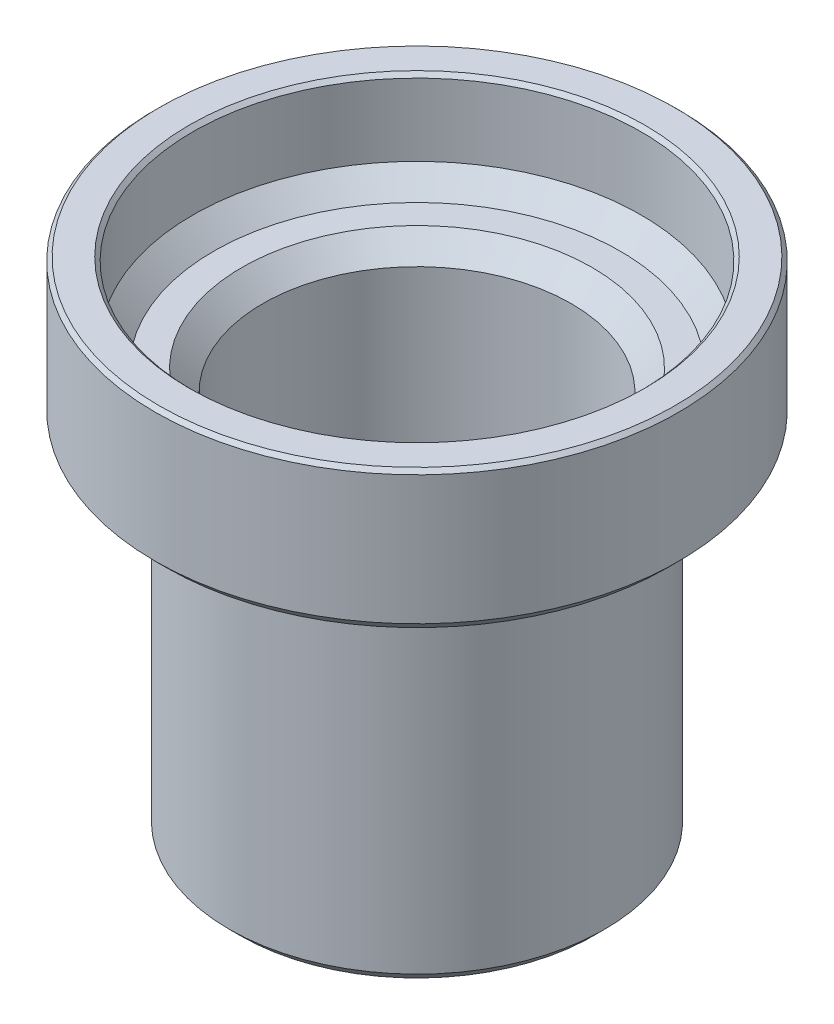
ISO-10303-21;
HEADER;
FILE_DESCRIPTION(('STEP AP214'),'2;1');
FILE_NAME('part.step','',(''),(''),'','','');
FILE_SCHEMA(('AUTOMOTIVE_DESIGN { 1 0 10303 214 1 1 1 1 }'));
ENDSEC;
DATA;
#1=APPLICATION_CONTEXT('core data for automotive mechanical design processes');
#2=APPLICATION_PROTOCOL_DEFINITION('international standard','automotive_design',2000,#1);
#3=PRODUCT_CONTEXT('',#1,'mechanical');
#4=PRODUCT('Part','Part','',(#3));
#5=PRODUCT_RELATED_PRODUCT_CATEGORY('part','',(#4));
#6=PRODUCT_DEFINITION_FORMATION('','',#4);
#7=PRODUCT_DEFINITION_CONTEXT('part definition',#1,'design');
#8=PRODUCT_DEFINITION('design','',#6,#7);
#9=PRODUCT_DEFINITION_SHAPE('','',#8);
#10=(LENGTH_UNIT() NAMED_UNIT(*) SI_UNIT(.MILLI.,.METRE.));
#11=(NAMED_UNIT(*) PLANE_ANGLE_UNIT() SI_UNIT($,.RADIAN.));
#12=(NAMED_UNIT(*) SI_UNIT($,.STERADIAN.) SOLID_ANGLE_UNIT());
#13=UNCERTAINTY_MEASURE_WITH_UNIT(LENGTH_MEASURE(1.E-05),#10,'distance_accuracy_value','');
#14=(GEOMETRIC_REPRESENTATION_CONTEXT(3) GLOBAL_UNCERTAINTY_ASSIGNED_CONTEXT((#13)) GLOBAL_UNIT_ASSIGNED_CONTEXT((#10,
#11,#12)) REPRESENTATION_CONTEXT('',''));
#15=CARTESIAN_POINT('',(0.,0.,0.));
#16=DIRECTION('',(0.,0.,1.));
#17=DIRECTION('',(1.,0.,0.));
#18=AXIS2_PLACEMENT_3D('',#15,#16,#17);
#19=CARTESIAN_POINT('',(0.,26.9875,0.));
#20=DIRECTION('',(0.,1.,0.));
#21=DIRECTION('',(0.,0.,1.));
#22=AXIS2_PLACEMENT_3D('',#19,#20,#21);
#23=PLANE('',#22);
#24=CARTESIAN_POINT('',(0.,26.9875,0.));
#25=DIRECTION('',(0.,1.,0.));
#26=DIRECTION('',(0.,0.,1.));
#27=AXIS2_PLACEMENT_3D('',#24,#25,#26);
#28=CIRCLE('',#27,11.71575);
#29=CARTESIAN_POINT('',(0.,26.9875,11.71575));
#30=VERTEX_POINT('',#29);
#31=EDGE_CURVE('E10',#30,#30,#28,.F.);
#32=ORIENTED_EDGE('',*,*,#31,.T.);
#33=EDGE_LOOP('',(#32));
#34=FACE_BOUND('',#33,.T.);
#35=CARTESIAN_POINT('',(0.,26.9875,0.));
#36=DIRECTION('',(0.,1.,0.));
#37=DIRECTION('',(0.,0.,1.));
#38=AXIS2_PLACEMENT_3D('',#35,#36,#37);
#39=CIRCLE('',#38,13.603);
#40=CARTESIAN_POINT('',(0.,26.9875,13.603));
#41=VERTEX_POINT('',#40);
#42=EDGE_CURVE('E56',#41,#41,#39,.T.);
#43=ORIENTED_EDGE('',*,*,#42,.T.);
#44=EDGE_LOOP('',(#43));
#45=FACE_BOUND('',#44,.T.);
#46=ADVANCED_FACE('F41',(#34,#45),#23,.T.);
#47=CARTESIAN_POINT('',(0.,26.9875,0.));
#48=DIRECTION('',(0.,-1.,0.));
#49=DIRECTION('',(0.,0.,-1.));
#50=AXIS2_PLACEMENT_3D('',#47,#48,#49);
#51=CYLINDRICAL_SURFACE('',#50,12.573);
#52=CARTESIAN_POINT('',(0.,0.762000000000002,0.));
#53=DIRECTION('',(0.,1.,0.));
#54=DIRECTION('',(0.,0.,1.));
#55=AXIS2_PLACEMENT_3D('',#52,#53,#54);
#56=CIRCLE('',#55,12.573);
#57=CARTESIAN_POINT('',(0.,0.762000000000002,12.573));
#58=VERTEX_POINT('',#57);
#59=EDGE_CURVE('E86',#58,#58,#56,.T.);
#60=ORIENTED_EDGE('',*,*,#59,.T.);
#61=EDGE_LOOP('',(#60));
#62=FACE_BOUND('',#61,.T.);
#63=CARTESIAN_POINT('',(0.,23.8125,0.));
#64=DIRECTION('',(0.,1.,0.));
#65=DIRECTION('',(0.,0.,1.));
#66=AXIS2_PLACEMENT_3D('',#63,#64,#65);
#67=CIRCLE('',#66,12.573);
#68=CARTESIAN_POINT('',(0.,23.8125,12.573));
#69=VERTEX_POINT('',#68);
#70=EDGE_CURVE('E98',#69,#69,#67,.T.);
#71=ORIENTED_EDGE('',*,*,#70,.F.);
#72=EDGE_LOOP('',(#71));
#73=FACE_BOUND('',#72,.T.);
#74=ADVANCED_FACE('F108',(#62,#73),#51,.T.);
#75=CARTESIAN_POINT('',(0.,0.,0.));
#76=DIRECTION('',(0.,1.,0.));
#77=DIRECTION('',(0.,0.,1.));
#78=AXIS2_PLACEMENT_3D('',#75,#76,#77);
#79=PLANE('',#78);
#80=CARTESIAN_POINT('',(0.,0.,0.));
#81=DIRECTION('',(0.,1.,0.));
#82=DIRECTION('',(0.,0.,1.));
#83=AXIS2_PLACEMENT_3D('',#80,#81,#82);
#84=CIRCLE('',#83,11.811);
#85=CARTESIAN_POINT('',(0.,0.,11.811));
#86=VERTEX_POINT('',#85);
#87=EDGE_CURVE('E82',#86,#86,#84,.F.);
#88=ORIENTED_EDGE('',*,*,#87,.T.);
#89=EDGE_LOOP('',(#88));
#90=FACE_BOUND('',#89,.T.);
#91=CARTESIAN_POINT('',(0.,0.,0.));
#92=DIRECTION('',(0.,1.,0.));
#93=DIRECTION('',(0.,0.,1.));
#94=AXIS2_PLACEMENT_3D('',#91,#92,#93);
#95=CIRCLE('',#94,10.31875);
#96=CARTESIAN_POINT('',(0.,0.,10.31875));
#97=VERTEX_POINT('',#96);
#98=EDGE_CURVE('E99',#97,#97,#95,.T.);
#99=ORIENTED_EDGE('',*,*,#98,.T.);
#100=EDGE_LOOP('',(#99));
#101=FACE_BOUND('',#100,.T.);
#102=ADVANCED_FACE('F110',(#90,#101),#79,.F.);
#103=CARTESIAN_POINT('',(0.,26.9875,0.));
#104=DIRECTION('',(0.,-1.,0.));
#105=DIRECTION('',(0.,0.,-1.));
#106=AXIS2_PLACEMENT_3D('',#103,#104,#105);
#107=CYLINDRICAL_SURFACE('',#106,10.31875);
#108=CARTESIAN_POINT('',(0.,25.5905,0.));
#109=DIRECTION('',(0.,1.,0.));
#110=DIRECTION('',(0.,0.,1.));
#111=AXIS2_PLACEMENT_3D('',#108,#109,#110);
#112=CIRCLE('',#111,10.31875);
#113=CARTESIAN_POINT('',(0.,25.5905,10.31875));
#114=VERTEX_POINT('',#113);
#115=EDGE_CURVE('E49',#114,#114,#112,.T.);
#116=ORIENTED_EDGE('',*,*,#115,.T.);
#117=EDGE_LOOP('',(#116));
#118=FACE_BOUND('',#117,.T.);
#119=ORIENTED_EDGE('',*,*,#98,.F.);
#120=EDGE_LOOP('',(#119));
#121=FACE_BOUND('',#120,.T.);
#122=ADVANCED_FACE('F117',(#118,#121),#107,.F.);
#123=CARTESIAN_POINT('',(0.,23.8125,0.));
#124=DIRECTION('',(0.,1.,0.));
#125=DIRECTION('',(0.,0.,1.));
#126=AXIS2_PLACEMENT_3D('',#123,#124,#125);
#127=PLANE('',#126);
#128=CARTESIAN_POINT('',(0.,23.8125,0.));
#129=DIRECTION('',(0.,1.,0.));
#130=DIRECTION('',(0.,0.,1.));
#131=AXIS2_PLACEMENT_3D('',#128,#129,#130);
#132=CIRCLE('',#131,16.764);
#133=CARTESIAN_POINT('',(0.,23.8125,16.764));
#134=VERTEX_POINT('',#133);
#135=EDGE_CURVE('E90',#134,#134,#132,.F.);
#136=ORIENTED_EDGE('',*,*,#135,.T.);
#137=EDGE_LOOP('',(#136));
#138=FACE_BOUND('',#137,.T.);
#139=ORIENTED_EDGE('',*,*,#70,.T.);
#140=EDGE_LOOP('',(#139));
#141=FACE_BOUND('',#140,.T.);
#142=ADVANCED_FACE('F106',(#138,#141),#127,.F.);
#143=CARTESIAN_POINT('',(0.,23.8125,0.));
#144=DIRECTION('',(0.,1.,0.));
#145=DIRECTION('',(0.,0.,1.));
#146=AXIS2_PLACEMENT_3D('',#143,#144,#145);
#147=CYLINDRICAL_SURFACE('',#146,17.526);
#148=CARTESIAN_POINT('',(0.,33.2105,0.));
#149=DIRECTION('',(0.,1.,0.));
#150=DIRECTION('',(0.,0.,1.));
#151=AXIS2_PLACEMENT_3D('',#148,#149,#150);
#152=CIRCLE('',#151,17.526);
#153=CARTESIAN_POINT('',(0.,33.2105,17.526));
#154=VERTEX_POINT('',#153);
#155=EDGE_CURVE('E74',#154,#154,#152,.F.);
#156=ORIENTED_EDGE('',*,*,#155,.T.);
#157=EDGE_LOOP('',(#156));
#158=FACE_BOUND('',#157,.T.);
#159=CARTESIAN_POINT('',(0.,24.5745,0.));
#160=DIRECTION('',(0.,1.,0.));
#161=DIRECTION('',(0.,0.,1.));
#162=AXIS2_PLACEMENT_3D('',#159,#160,#161);
#163=CIRCLE('',#162,17.526);
#164=CARTESIAN_POINT('',(0.,24.5745,17.526));
#165=VERTEX_POINT('',#164);
#166=EDGE_CURVE('E94',#165,#165,#163,.T.);
#167=ORIENTED_EDGE('',*,*,#166,.T.);
#168=EDGE_LOOP('',(#167));
#169=FACE_BOUND('',#168,.T.);
#170=ADVANCED_FACE('F158',(#158,#169),#147,.T.);
#171=CARTESIAN_POINT('',(0.,33.4645,0.));
#172=DIRECTION('',(0.,1.,0.));
#173=DIRECTION('',(0.,0.,1.));
#174=AXIS2_PLACEMENT_3D('',#171,#172,#173);
#175=PLANE('',#174);
#176=CARTESIAN_POINT('',(0.,33.4645,0.));
#177=DIRECTION('',(0.,1.,0.));
#178=DIRECTION('',(0.,0.,1.));
#179=AXIS2_PLACEMENT_3D('',#176,#177,#178);
#180=CIRCLE('',#179,15.254);
#181=CARTESIAN_POINT('',(0.,33.4645,15.254));
#182=VERTEX_POINT('',#181);
#183=EDGE_CURVE('E66',#182,#182,#180,.F.);
#184=ORIENTED_EDGE('',*,*,#183,.T.);
#185=EDGE_LOOP('',(#184));
#186=FACE_BOUND('',#185,.T.);
#187=CARTESIAN_POINT('',(0.,33.4645,0.));
#188=DIRECTION('',(0.,1.,0.));
#189=DIRECTION('',(0.,0.,1.));
#190=AXIS2_PLACEMENT_3D('',#187,#188,#189);
#191=CIRCLE('',#190,17.272);
#192=CARTESIAN_POINT('',(0.,33.4645,17.272));
#193=VERTEX_POINT('',#192);
#194=EDGE_CURVE('E78',#193,#193,#191,.T.);
#195=ORIENTED_EDGE('',*,*,#194,.T.);
#196=EDGE_LOOP('',(#195));
#197=FACE_BOUND('',#196,.T.);
#198=ADVANCED_FACE('F151',(#186,#197),#175,.T.);
#199=CARTESIAN_POINT('',(0.,33.4645,0.));
#200=DIRECTION('',(0.,-1.,0.));
#201=DIRECTION('',(0.,0.,-1.));
#202=AXIS2_PLACEMENT_3D('',#199,#200,#201);
#203=CYLINDRICAL_SURFACE('',#202,15.);
#204=CARTESIAN_POINT('',(0.,28.3845,0.));
#205=DIRECTION('',(0.,1.,0.));
#206=DIRECTION('',(0.,0.,1.));
#207=AXIS2_PLACEMENT_3D('',#204,#205,#206);
#208=CIRCLE('',#207,15.);
#209=CARTESIAN_POINT('',(0.,28.3845,15.));
#210=VERTEX_POINT('',#209);
#211=EDGE_CURVE('E60',#210,#210,#208,.F.);
#212=ORIENTED_EDGE('',*,*,#211,.T.);
#213=EDGE_LOOP('',(#212));
#214=FACE_BOUND('',#213,.T.);
#215=CARTESIAN_POINT('',(0.,33.2105,0.));
#216=DIRECTION('',(0.,1.,0.));
#217=DIRECTION('',(0.,0.,1.));
#218=AXIS2_PLACEMENT_3D('',#215,#216,#217);
#219=CIRCLE('',#218,15.);
#220=CARTESIAN_POINT('',(0.,33.2105,15.));
#221=VERTEX_POINT('',#220);
#222=EDGE_CURVE('E70',#221,#221,#219,.T.);
#223=ORIENTED_EDGE('',*,*,#222,.T.);
#224=EDGE_LOOP('',(#223));
#225=FACE_BOUND('',#224,.T.);
#226=ADVANCED_FACE('F126',(#214,#225),#203,.F.);
#227=CARTESIAN_POINT('',(0.,24.5745,0.));
#228=DIRECTION('',(0.,1.,0.));
#229=DIRECTION('',(0.,0.,1.));
#230=AXIS2_PLACEMENT_3D('',#227,#228,#229);
#231=CONICAL_SURFACE('',#230,17.526,0.785398163397455);
#232=ORIENTED_EDGE('',*,*,#135,.F.);
#233=EDGE_LOOP('',(#232));
#234=FACE_BOUND('',#233,.T.);
#235=ORIENTED_EDGE('',*,*,#166,.F.);
#236=EDGE_LOOP('',(#235));
#237=FACE_BOUND('',#236,.T.);
#238=ADVANCED_FACE('F122',(#234,#237),#231,.T.);
#239=CARTESIAN_POINT('',(0.,0.762000000000002,0.));
#240=DIRECTION('',(0.,1.,0.));
#241=DIRECTION('',(0.,0.,1.));
#242=AXIS2_PLACEMENT_3D('',#239,#240,#241);
#243=CONICAL_SURFACE('',#242,12.573,0.785398163397452);
#244=ORIENTED_EDGE('',*,*,#87,.F.);
#245=EDGE_LOOP('',(#244));
#246=FACE_BOUND('',#245,.T.);
#247=ORIENTED_EDGE('',*,*,#59,.F.);
#248=EDGE_LOOP('',(#247));
#249=FACE_BOUND('',#248,.T.);
#250=ADVANCED_FACE('F125',(#246,#249),#243,.T.);
#251=CARTESIAN_POINT('',(0.,33.4645,0.));
#252=DIRECTION('',(0.,-1.,0.));
#253=DIRECTION('',(0.,0.,-1.));
#254=AXIS2_PLACEMENT_3D('',#251,#252,#253);
#255=CONICAL_SURFACE('',#254,17.272,0.785398163397442);
#256=ORIENTED_EDGE('',*,*,#155,.F.);
#257=EDGE_LOOP('',(#256));
#258=FACE_BOUND('',#257,.T.);
#259=ORIENTED_EDGE('',*,*,#194,.F.);
#260=EDGE_LOOP('',(#259));
#261=FACE_BOUND('',#260,.T.);
#262=ADVANCED_FACE('F130',(#258,#261),#255,.T.);
#263=CARTESIAN_POINT('',(0.,33.2105,0.));
#264=DIRECTION('',(0.,1.,0.));
#265=DIRECTION('',(0.,0.,1.));
#266=AXIS2_PLACEMENT_3D('',#263,#264,#265);
#267=CONICAL_SURFACE('',#266,15.,0.785398163397431);
#268=ORIENTED_EDGE('',*,*,#183,.F.);
#269=EDGE_LOOP('',(#268));
#270=FACE_BOUND('',#269,.T.);
#271=ORIENTED_EDGE('',*,*,#222,.F.);
#272=EDGE_LOOP('',(#271));
#273=FACE_BOUND('',#272,.T.);
#274=ADVANCED_FACE('F134',(#270,#273),#267,.F.);
#275=CARTESIAN_POINT('',(0.,28.3845,0.));
#276=DIRECTION('',(0.,1.,0.));
#277=DIRECTION('',(0.,0.,1.));
#278=AXIS2_PLACEMENT_3D('',#275,#276,#277);
#279=CONICAL_SURFACE('',#278,15.,0.785398163397443);
#280=ORIENTED_EDGE('',*,*,#42,.F.);
#281=EDGE_LOOP('',(#280));
#282=FACE_BOUND('',#281,.T.);
#283=ORIENTED_EDGE('',*,*,#211,.F.);
#284=EDGE_LOOP('',(#283));
#285=FACE_BOUND('',#284,.T.);
#286=ADVANCED_FACE('F137',(#282,#285),#279,.F.);
#287=CARTESIAN_POINT('',(0.,25.5905,0.));
#288=DIRECTION('',(0.,1.,0.));
#289=DIRECTION('',(0.,0.,1.));
#290=AXIS2_PLACEMENT_3D('',#287,#288,#289);
#291=CONICAL_SURFACE('',#290,10.31875,0.78539816339745);
#292=ORIENTED_EDGE('',*,*,#31,.F.);
#293=EDGE_LOOP('',(#292));
#294=FACE_BOUND('',#293,.T.);
#295=ORIENTED_EDGE('',*,*,#115,.F.);
#296=EDGE_LOOP('',(#295));
#297=FACE_BOUND('',#296,.T.);
#298=ADVANCED_FACE('F43',(#294,#297),#291,.F.);
#299=CLOSED_SHELL('',(#46,#74,#102,#122,#142,#170,#198,#226,#238,#250,#262,#274,#286,#298));
#300=MANIFOLD_SOLID_BREP('B2',#299);
#301=ADVANCED_BREP_SHAPE_REPRESENTATION('',(#18,#300),#14);
#302=SHAPE_DEFINITION_REPRESENTATION(#9,#301);
ENDSEC;
END-ISO-10303-21;
